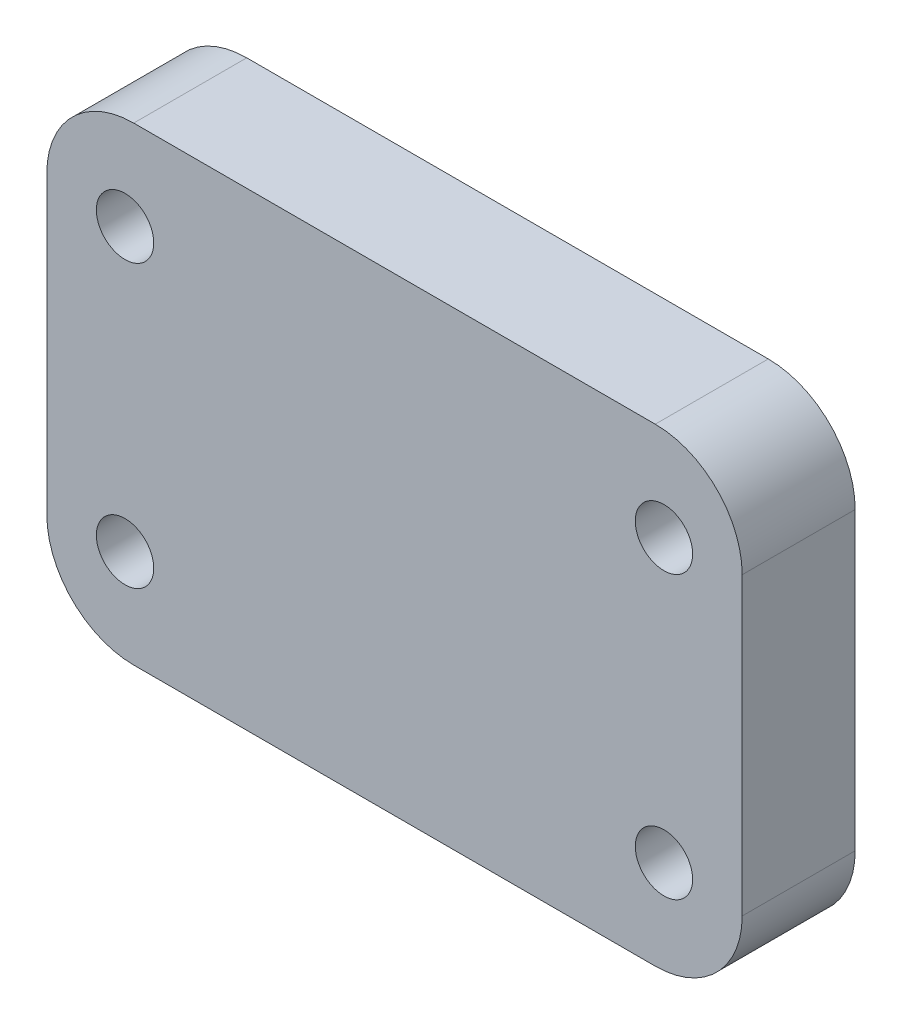
ISO-10303-21;
HEADER;
FILE_DESCRIPTION(('STEP AP214'),'2;1');
FILE_NAME('part.step','',(''),(''),'','','');
FILE_SCHEMA(('AUTOMOTIVE_DESIGN { 1 0 10303 214 1 1 1 1 }'));
ENDSEC;
DATA;
#1=APPLICATION_CONTEXT('core data for automotive mechanical design processes');
#2=APPLICATION_PROTOCOL_DEFINITION('international standard','automotive_design',2000,#1);
#3=PRODUCT_CONTEXT('',#1,'mechanical');
#4=PRODUCT('Part','Part','',(#3));
#5=PRODUCT_RELATED_PRODUCT_CATEGORY('part','',(#4));
#6=PRODUCT_DEFINITION_FORMATION('','',#4);
#7=PRODUCT_DEFINITION_CONTEXT('part definition',#1,'design');
#8=PRODUCT_DEFINITION('design','',#6,#7);
#9=PRODUCT_DEFINITION_SHAPE('','',#8);
#10=(LENGTH_UNIT() NAMED_UNIT(*) SI_UNIT(.MILLI.,.METRE.));
#11=(NAMED_UNIT(*) PLANE_ANGLE_UNIT() SI_UNIT($,.RADIAN.));
#12=(NAMED_UNIT(*) SI_UNIT($,.STERADIAN.) SOLID_ANGLE_UNIT());
#13=UNCERTAINTY_MEASURE_WITH_UNIT(LENGTH_MEASURE(1.E-05),#10,'distance_accuracy_value','');
#14=(GEOMETRIC_REPRESENTATION_CONTEXT(3) GLOBAL_UNCERTAINTY_ASSIGNED_CONTEXT((#13)) GLOBAL_UNIT_ASSIGNED_CONTEXT((#10,
#11,#12)) REPRESENTATION_CONTEXT('',''));
#15=CARTESIAN_POINT('',(0.,0.,0.));
#16=DIRECTION('',(0.,0.,1.));
#17=DIRECTION('',(1.,0.,0.));
#18=AXIS2_PLACEMENT_3D('',#15,#16,#17);
#19=CARTESIAN_POINT('',(0.,29.,26.));
#20=DIRECTION('',(0.,0.,1.));
#21=DIRECTION('',(1.,0.,0.));
#22=AXIS2_PLACEMENT_3D('',#19,#20,#21);
#23=PLANE('',#22);
#24=CARTESIAN_POINT('',(-31.,12.8,26.));
#25=DIRECTION('',(0.,0.,-1.));
#26=DIRECTION('',(-1.,0.,0.));
#27=AXIS2_PLACEMENT_3D('',#24,#25,#26);
#28=CIRCLE('',#27,3.3);
#29=CARTESIAN_POINT('',(-34.3,12.8,26.));
#30=VERTEX_POINT('',#29);
#31=EDGE_CURVE('E137',#30,#30,#28,.T.);
#32=ORIENTED_EDGE('',*,*,#31,.T.);
#33=EDGE_LOOP('',(#32));
#34=FACE_BOUND('',#33,.T.);
#35=CARTESIAN_POINT('',(31.,12.8,26.));
#36=DIRECTION('',(0.,0.,-1.));
#37=DIRECTION('',(-1.,0.,0.));
#38=AXIS2_PLACEMENT_3D('',#35,#36,#37);
#39=CIRCLE('',#38,3.3);
#40=CARTESIAN_POINT('',(27.7,12.8,26.));
#41=VERTEX_POINT('',#40);
#42=EDGE_CURVE('E140',#41,#41,#39,.T.);
#43=ORIENTED_EDGE('',*,*,#42,.T.);
#44=EDGE_LOOP('',(#43));
#45=FACE_BOUND('',#44,.T.);
#46=CARTESIAN_POINT('',(31.,45.2,26.));
#47=DIRECTION('',(0.,0.,-1.));
#48=DIRECTION('',(-1.,0.,0.));
#49=AXIS2_PLACEMENT_3D('',#46,#47,#48);
#50=CIRCLE('',#49,3.3);
#51=CARTESIAN_POINT('',(27.7,45.2,26.));
#52=VERTEX_POINT('',#51);
#53=EDGE_CURVE('E143',#52,#52,#50,.T.);
#54=ORIENTED_EDGE('',*,*,#53,.T.);
#55=EDGE_LOOP('',(#54));
#56=FACE_BOUND('',#55,.T.);
#57=CARTESIAN_POINT('',(-31.,45.2,26.));
#58=DIRECTION('',(0.,0.,-1.));
#59=DIRECTION('',(-1.,0.,0.));
#60=AXIS2_PLACEMENT_3D('',#57,#58,#59);
#61=CIRCLE('',#60,3.3);
#62=CARTESIAN_POINT('',(-34.3,45.2,26.));
#63=VERTEX_POINT('',#62);
#64=EDGE_CURVE('E146',#63,#63,#61,.T.);
#65=ORIENTED_EDGE('',*,*,#64,.T.);
#66=EDGE_LOOP('',(#65));
#67=FACE_BOUND('',#66,.T.);
#68=CARTESIAN_POINT('',(30.,46.,26.));
#69=DIRECTION('',(0.,0.,1.));
#70=DIRECTION('',(1.,0.,0.));
#71=AXIS2_PLACEMENT_3D('',#68,#69,#70);
#72=CIRCLE('',#71,10.);
#73=CARTESIAN_POINT('',(30.,56.,26.));
#74=VERTEX_POINT('',#73);
#75=CARTESIAN_POINT('',(40.,46.,26.));
#76=VERTEX_POINT('',#75);
#77=EDGE_CURVE('E151',#74,#76,#72,.F.);
#78=ORIENTED_EDGE('',*,*,#77,.F.);
#79=DIRECTION('',(-1.,0.,0.));
#80=VECTOR('',#79,1.);
#81=CARTESIAN_POINT('',(30.,56.,26.));
#82=LINE('',#81,#80);
#83=CARTESIAN_POINT('',(-30.,56.,26.));
#84=VERTEX_POINT('',#83);
#85=EDGE_CURVE('E108',#84,#74,#82,.F.);
#86=ORIENTED_EDGE('',*,*,#85,.F.);
#87=CARTESIAN_POINT('',(-30.,46.,26.));
#88=DIRECTION('',(0.,0.,1.));
#89=DIRECTION('',(1.,0.,0.));
#90=AXIS2_PLACEMENT_3D('',#87,#88,#89);
#91=CIRCLE('',#90,10.);
#92=CARTESIAN_POINT('',(-40.,46.,26.));
#93=VERTEX_POINT('',#92);
#94=EDGE_CURVE('E95',#93,#84,#91,.F.);
#95=ORIENTED_EDGE('',*,*,#94,.F.);
#96=DIRECTION('',(0.,-1.,0.));
#97=VECTOR('',#96,1.);
#98=CARTESIAN_POINT('',(-40.,46.,26.));
#99=LINE('',#98,#97);
#100=CARTESIAN_POINT('',(-40.,12.,26.));
#101=VERTEX_POINT('',#100);
#102=EDGE_CURVE('E91',#101,#93,#99,.F.);
#103=ORIENTED_EDGE('',*,*,#102,.F.);
#104=CARTESIAN_POINT('',(-30.,12.,26.));
#105=DIRECTION('',(0.,0.,1.));
#106=DIRECTION('',(1.,0.,0.));
#107=AXIS2_PLACEMENT_3D('',#104,#105,#106);
#108=CIRCLE('',#107,10.);
#109=CARTESIAN_POINT('',(-30.,2.00000000000001,26.));
#110=VERTEX_POINT('',#109);
#111=EDGE_CURVE('E19',#110,#101,#108,.F.);
#112=ORIENTED_EDGE('',*,*,#111,.F.);
#113=DIRECTION('',(1.,0.,0.));
#114=VECTOR('',#113,1.);
#115=CARTESIAN_POINT('',(-30.,2.00000000000001,26.));
#116=LINE('',#115,#114);
#117=CARTESIAN_POINT('',(30.,2.00000000000001,26.));
#118=VERTEX_POINT('',#117);
#119=EDGE_CURVE('E78',#118,#110,#116,.F.);
#120=ORIENTED_EDGE('',*,*,#119,.F.);
#121=CARTESIAN_POINT('',(30.,12.,26.));
#122=DIRECTION('',(0.,0.,1.));
#123=DIRECTION('',(1.,0.,0.));
#124=AXIS2_PLACEMENT_3D('',#121,#122,#123);
#125=CIRCLE('',#124,10.);
#126=CARTESIAN_POINT('',(40.,12.,26.));
#127=VERTEX_POINT('',#126);
#128=EDGE_CURVE('E152',#127,#118,#125,.F.);
#129=ORIENTED_EDGE('',*,*,#128,.F.);
#130=DIRECTION('',(0.,1.,0.));
#131=VECTOR('',#130,1.);
#132=CARTESIAN_POINT('',(40.,12.,26.));
#133=LINE('',#132,#131);
#134=EDGE_CURVE('E112',#76,#127,#133,.F.);
#135=ORIENTED_EDGE('',*,*,#134,.F.);
#136=EDGE_LOOP('',(#78,#86,#95,#103,#112,#120,#129,#135));
#137=FACE_BOUND('',#136,.T.);
#138=ADVANCED_FACE('F16',(#34,#45,#56,#67,#137),#23,.T.);
#139=CARTESIAN_POINT('',(-40.,46.,13.));
#140=DIRECTION('',(-1.,0.,0.));
#141=DIRECTION('',(0.,-1.,0.));
#142=AXIS2_PLACEMENT_3D('',#139,#140,#141);
#143=PLANE('',#142);
#144=ORIENTED_EDGE('',*,*,#102,.T.);
#145=DIRECTION('',(0.,0.,1.));
#146=VECTOR('',#145,1.);
#147=CARTESIAN_POINT('',(-40.,46.,13.));
#148=LINE('',#147,#146);
#149=CARTESIAN_POINT('',(-40.,46.,13.));
#150=VERTEX_POINT('',#149);
#151=EDGE_CURVE('E150',#150,#93,#148,.T.);
#152=ORIENTED_EDGE('',*,*,#151,.F.);
#153=DIRECTION('',(0.,1.,0.));
#154=VECTOR('',#153,1.);
#155=CARTESIAN_POINT('',(-40.,29.,13.));
#156=LINE('',#155,#154);
#157=CARTESIAN_POINT('',(-40.,12.,13.));
#158=VERTEX_POINT('',#157);
#159=EDGE_CURVE('E102',#150,#158,#156,.F.);
#160=ORIENTED_EDGE('',*,*,#159,.T.);
#161=DIRECTION('',(0.,0.,1.));
#162=VECTOR('',#161,1.);
#163=CARTESIAN_POINT('',(-40.,12.,13.));
#164=LINE('',#163,#162);
#165=EDGE_CURVE('E87',#101,#158,#164,.F.);
#166=ORIENTED_EDGE('',*,*,#165,.F.);
#167=EDGE_LOOP('',(#144,#152,#160,#166));
#168=FACE_BOUND('',#167,.T.);
#169=ADVANCED_FACE('F101',(#168),#143,.T.);
#170=CARTESIAN_POINT('',(-30.,12.,13.));
#171=DIRECTION('',(0.,0.,1.));
#172=DIRECTION('',(1.,0.,0.));
#173=AXIS2_PLACEMENT_3D('',#170,#171,#172);
#174=CYLINDRICAL_SURFACE('',#173,10.);
#175=ORIENTED_EDGE('',*,*,#111,.T.);
#176=ORIENTED_EDGE('',*,*,#165,.T.);
#177=CARTESIAN_POINT('',(-30.,12.,13.));
#178=DIRECTION('',(0.,0.,1.));
#179=DIRECTION('',(1.,0.,0.));
#180=AXIS2_PLACEMENT_3D('',#177,#178,#179);
#181=CIRCLE('',#180,10.);
#182=CARTESIAN_POINT('',(-30.,2.00000000000001,13.));
#183=VERTEX_POINT('',#182);
#184=EDGE_CURVE('E135',#158,#183,#181,.T.);
#185=ORIENTED_EDGE('',*,*,#184,.T.);
#186=DIRECTION('',(0.,0.,1.));
#187=VECTOR('',#186,1.);
#188=CARTESIAN_POINT('',(-30.,2.00000000000001,13.));
#189=LINE('',#188,#187);
#190=EDGE_CURVE('E89',#110,#183,#189,.F.);
#191=ORIENTED_EDGE('',*,*,#190,.F.);
#192=EDGE_LOOP('',(#175,#176,#185,#191));
#193=FACE_BOUND('',#192,.T.);
#194=ADVANCED_FACE('F84',(#193),#174,.T.);
#195=CARTESIAN_POINT('',(-30.,2.00000000000001,13.));
#196=DIRECTION('',(0.,-1.,0.));
#197=DIRECTION('',(1.,0.,0.));
#198=AXIS2_PLACEMENT_3D('',#195,#196,#197);
#199=PLANE('',#198);
#200=ORIENTED_EDGE('',*,*,#119,.T.);
#201=ORIENTED_EDGE('',*,*,#190,.T.);
#202=DIRECTION('',(1.,0.,0.));
#203=VECTOR('',#202,1.);
#204=CARTESIAN_POINT('',(0.,2.00000000000001,13.));
#205=LINE('',#204,#203);
#206=CARTESIAN_POINT('',(30.,2.00000000000001,13.));
#207=VERTEX_POINT('',#206);
#208=EDGE_CURVE('E134',#183,#207,#205,.T.);
#209=ORIENTED_EDGE('',*,*,#208,.T.);
#210=DIRECTION('',(0.,0.,1.));
#211=VECTOR('',#210,1.);
#212=CARTESIAN_POINT('',(30.,2.,13.));
#213=LINE('',#212,#211);
#214=EDGE_CURVE('E114',#118,#207,#213,.F.);
#215=ORIENTED_EDGE('',*,*,#214,.F.);
#216=EDGE_LOOP('',(#200,#201,#209,#215));
#217=FACE_BOUND('',#216,.T.);
#218=ADVANCED_FACE('F158',(#217),#199,.T.);
#219=CARTESIAN_POINT('',(30.,12.,13.));
#220=DIRECTION('',(0.,0.,1.));
#221=DIRECTION('',(1.,0.,0.));
#222=AXIS2_PLACEMENT_3D('',#219,#220,#221);
#223=CYLINDRICAL_SURFACE('',#222,10.);
#224=ORIENTED_EDGE('',*,*,#128,.T.);
#225=ORIENTED_EDGE('',*,*,#214,.T.);
#226=CARTESIAN_POINT('',(30.,12.,13.));
#227=DIRECTION('',(0.,0.,1.));
#228=DIRECTION('',(1.,0.,0.));
#229=AXIS2_PLACEMENT_3D('',#226,#227,#228);
#230=CIRCLE('',#229,10.);
#231=CARTESIAN_POINT('',(40.,12.,13.));
#232=VERTEX_POINT('',#231);
#233=EDGE_CURVE('E131',#207,#232,#230,.T.);
#234=ORIENTED_EDGE('',*,*,#233,.T.);
#235=DIRECTION('',(0.,0.,-1.));
#236=VECTOR('',#235,1.);
#237=CARTESIAN_POINT('',(40.,12.,13.));
#238=LINE('',#237,#236);
#239=EDGE_CURVE('E113',#127,#232,#238,.T.);
#240=ORIENTED_EDGE('',*,*,#239,.F.);
#241=EDGE_LOOP('',(#224,#225,#234,#240));
#242=FACE_BOUND('',#241,.T.);
#243=ADVANCED_FACE('F179',(#242),#223,.T.);
#244=CARTESIAN_POINT('',(40.,12.,13.));
#245=DIRECTION('',(1.,0.,0.));
#246=DIRECTION('',(0.,0.,-1.));
#247=AXIS2_PLACEMENT_3D('',#244,#245,#246);
#248=PLANE('',#247);
#249=ORIENTED_EDGE('',*,*,#134,.T.);
#250=ORIENTED_EDGE('',*,*,#239,.T.);
#251=DIRECTION('',(0.,1.,0.));
#252=VECTOR('',#251,1.);
#253=CARTESIAN_POINT('',(40.,29.,13.));
#254=LINE('',#253,#252);
#255=CARTESIAN_POINT('',(40.,46.,13.));
#256=VERTEX_POINT('',#255);
#257=EDGE_CURVE('E130',#232,#256,#254,.T.);
#258=ORIENTED_EDGE('',*,*,#257,.T.);
#259=DIRECTION('',(0.,0.,1.));
#260=VECTOR('',#259,1.);
#261=CARTESIAN_POINT('',(40.,46.,13.));
#262=LINE('',#261,#260);
#263=EDGE_CURVE('E110',#76,#256,#262,.F.);
#264=ORIENTED_EDGE('',*,*,#263,.F.);
#265=EDGE_LOOP('',(#249,#250,#258,#264));
#266=FACE_BOUND('',#265,.T.);
#267=ADVANCED_FACE('F175',(#266),#248,.T.);
#268=CARTESIAN_POINT('',(30.,46.,13.));
#269=DIRECTION('',(0.,0.,1.));
#270=DIRECTION('',(1.,0.,0.));
#271=AXIS2_PLACEMENT_3D('',#268,#269,#270);
#272=CYLINDRICAL_SURFACE('',#271,10.);
#273=ORIENTED_EDGE('',*,*,#77,.T.);
#274=ORIENTED_EDGE('',*,*,#263,.T.);
#275=CARTESIAN_POINT('',(30.,46.,13.));
#276=DIRECTION('',(0.,0.,1.));
#277=DIRECTION('',(1.,0.,0.));
#278=AXIS2_PLACEMENT_3D('',#275,#276,#277);
#279=CIRCLE('',#278,10.);
#280=CARTESIAN_POINT('',(30.,56.,13.));
#281=VERTEX_POINT('',#280);
#282=EDGE_CURVE('E127',#256,#281,#279,.T.);
#283=ORIENTED_EDGE('',*,*,#282,.T.);
#284=DIRECTION('',(0.,0.,1.));
#285=VECTOR('',#284,1.);
#286=CARTESIAN_POINT('',(30.,56.,13.));
#287=LINE('',#286,#285);
#288=EDGE_CURVE('E109',#74,#281,#287,.F.);
#289=ORIENTED_EDGE('',*,*,#288,.F.);
#290=EDGE_LOOP('',(#273,#274,#283,#289));
#291=FACE_BOUND('',#290,.T.);
#292=ADVANCED_FACE('F187',(#291),#272,.T.);
#293=CARTESIAN_POINT('',(30.,56.,13.));
#294=DIRECTION('',(0.,1.,0.));
#295=DIRECTION('',(-1.,0.,0.));
#296=AXIS2_PLACEMENT_3D('',#293,#294,#295);
#297=PLANE('',#296);
#298=ORIENTED_EDGE('',*,*,#85,.T.);
#299=ORIENTED_EDGE('',*,*,#288,.T.);
#300=DIRECTION('',(1.,0.,0.));
#301=VECTOR('',#300,1.);
#302=CARTESIAN_POINT('',(0.,56.,13.));
#303=LINE('',#302,#301);
#304=CARTESIAN_POINT('',(-30.,56.,13.));
#305=VERTEX_POINT('',#304);
#306=EDGE_CURVE('E126',#281,#305,#303,.F.);
#307=ORIENTED_EDGE('',*,*,#306,.T.);
#308=DIRECTION('',(0.,0.,1.));
#309=VECTOR('',#308,1.);
#310=CARTESIAN_POINT('',(-30.,56.,13.));
#311=LINE('',#310,#309);
#312=EDGE_CURVE('E34',#84,#305,#311,.F.);
#313=ORIENTED_EDGE('',*,*,#312,.F.);
#314=EDGE_LOOP('',(#298,#299,#307,#313));
#315=FACE_BOUND('',#314,.T.);
#316=ADVANCED_FACE('F217',(#315),#297,.T.);
#317=CARTESIAN_POINT('',(-30.,46.,13.));
#318=DIRECTION('',(0.,0.,1.));
#319=DIRECTION('',(1.,0.,0.));
#320=AXIS2_PLACEMENT_3D('',#317,#318,#319);
#321=CYLINDRICAL_SURFACE('',#320,10.);
#322=ORIENTED_EDGE('',*,*,#94,.T.);
#323=ORIENTED_EDGE('',*,*,#312,.T.);
#324=CARTESIAN_POINT('',(-30.,46.,13.));
#325=DIRECTION('',(0.,0.,1.));
#326=DIRECTION('',(1.,0.,0.));
#327=AXIS2_PLACEMENT_3D('',#324,#325,#326);
#328=CIRCLE('',#327,10.);
#329=EDGE_CURVE('E124',#305,#150,#328,.T.);
#330=ORIENTED_EDGE('',*,*,#329,.T.);
#331=ORIENTED_EDGE('',*,*,#151,.T.);
#332=EDGE_LOOP('',(#322,#323,#330,#331));
#333=FACE_BOUND('',#332,.T.);
#334=ADVANCED_FACE('F213',(#333),#321,.T.);
#335=CARTESIAN_POINT('',(-31.,45.2,23.4));
#336=DIRECTION('',(0.,0.,-1.));
#337=DIRECTION('',(-1.,0.,0.));
#338=AXIS2_PLACEMENT_3D('',#335,#336,#337);
#339=CYLINDRICAL_SURFACE('',#338,3.3);
#340=CARTESIAN_POINT('',(-31.,45.2,13.));
#341=DIRECTION('',(0.,0.,-1.));
#342=DIRECTION('',(-1.,0.,0.));
#343=AXIS2_PLACEMENT_3D('',#340,#341,#342);
#344=CIRCLE('',#343,3.3);
#345=CARTESIAN_POINT('',(-34.3,45.2,13.));
#346=VERTEX_POINT('',#345);
#347=EDGE_CURVE('E121',#346,#346,#344,.T.);
#348=ORIENTED_EDGE('',*,*,#347,.T.);
#349=EDGE_LOOP('',(#348));
#350=FACE_BOUND('',#349,.T.);
#351=ORIENTED_EDGE('',*,*,#64,.F.);
#352=EDGE_LOOP('',(#351));
#353=FACE_BOUND('',#352,.T.);
#354=ADVANCED_FACE('F209',(#350,#353),#339,.F.);
#355=CARTESIAN_POINT('',(31.,45.2,23.4));
#356=DIRECTION('',(0.,0.,-1.));
#357=DIRECTION('',(-1.,0.,0.));
#358=AXIS2_PLACEMENT_3D('',#355,#356,#357);
#359=CYLINDRICAL_SURFACE('',#358,3.3);
#360=CARTESIAN_POINT('',(31.,45.2,13.));
#361=DIRECTION('',(0.,0.,-1.));
#362=DIRECTION('',(-1.,0.,0.));
#363=AXIS2_PLACEMENT_3D('',#360,#361,#362);
#364=CIRCLE('',#363,3.3);
#365=CARTESIAN_POINT('',(27.7,45.2,13.));
#366=VERTEX_POINT('',#365);
#367=EDGE_CURVE('E118',#366,#366,#364,.T.);
#368=ORIENTED_EDGE('',*,*,#367,.T.);
#369=EDGE_LOOP('',(#368));
#370=FACE_BOUND('',#369,.T.);
#371=ORIENTED_EDGE('',*,*,#53,.F.);
#372=EDGE_LOOP('',(#371));
#373=FACE_BOUND('',#372,.T.);
#374=ADVANCED_FACE('F205',(#370,#373),#359,.F.);
#375=CARTESIAN_POINT('',(31.,12.8,23.4));
#376=DIRECTION('',(0.,0.,-1.));
#377=DIRECTION('',(-1.,0.,0.));
#378=AXIS2_PLACEMENT_3D('',#375,#376,#377);
#379=CYLINDRICAL_SURFACE('',#378,3.3);
#380=CARTESIAN_POINT('',(31.,12.8,13.));
#381=DIRECTION('',(0.,0.,-1.));
#382=DIRECTION('',(-1.,0.,0.));
#383=AXIS2_PLACEMENT_3D('',#380,#381,#382);
#384=CIRCLE('',#383,3.3);
#385=CARTESIAN_POINT('',(27.7,12.8,13.));
#386=VERTEX_POINT('',#385);
#387=EDGE_CURVE('E25',#386,#386,#384,.T.);
#388=ORIENTED_EDGE('',*,*,#387,.T.);
#389=EDGE_LOOP('',(#388));
#390=FACE_BOUND('',#389,.T.);
#391=ORIENTED_EDGE('',*,*,#42,.F.);
#392=EDGE_LOOP('',(#391));
#393=FACE_BOUND('',#392,.T.);
#394=ADVANCED_FACE('F197',(#390,#393),#379,.F.);
#395=CARTESIAN_POINT('',(-31.,12.8,23.4));
#396=DIRECTION('',(0.,0.,-1.));
#397=DIRECTION('',(-1.,0.,0.));
#398=AXIS2_PLACEMENT_3D('',#395,#396,#397);
#399=CYLINDRICAL_SURFACE('',#398,3.3);
#400=CARTESIAN_POINT('',(-31.,12.8,13.));
#401=DIRECTION('',(0.,0.,-1.));
#402=DIRECTION('',(-1.,0.,0.));
#403=AXIS2_PLACEMENT_3D('',#400,#401,#402);
#404=CIRCLE('',#403,3.3);
#405=CARTESIAN_POINT('',(-34.3,12.8,13.));
#406=VERTEX_POINT('',#405);
#407=EDGE_CURVE('E11',#406,#406,#404,.T.);
#408=ORIENTED_EDGE('',*,*,#407,.T.);
#409=EDGE_LOOP('',(#408));
#410=FACE_BOUND('',#409,.T.);
#411=ORIENTED_EDGE('',*,*,#31,.F.);
#412=EDGE_LOOP('',(#411));
#413=FACE_BOUND('',#412,.T.);
#414=ADVANCED_FACE('F191',(#410,#413),#399,.F.);
#415=CARTESIAN_POINT('',(0.,29.,13.));
#416=DIRECTION('',(0.,0.,1.));
#417=DIRECTION('',(1.,0.,0.));
#418=AXIS2_PLACEMENT_3D('',#415,#416,#417);
#419=PLANE('',#418);
#420=ORIENTED_EDGE('',*,*,#407,.F.);
#421=EDGE_LOOP('',(#420));
#422=FACE_BOUND('',#421,.T.);
#423=ORIENTED_EDGE('',*,*,#387,.F.);
#424=EDGE_LOOP('',(#423));
#425=FACE_BOUND('',#424,.T.);
#426=ORIENTED_EDGE('',*,*,#367,.F.);
#427=EDGE_LOOP('',(#426));
#428=FACE_BOUND('',#427,.T.);
#429=ORIENTED_EDGE('',*,*,#347,.F.);
#430=EDGE_LOOP('',(#429));
#431=FACE_BOUND('',#430,.T.);
#432=ORIENTED_EDGE('',*,*,#306,.F.);
#433=ORIENTED_EDGE('',*,*,#282,.F.);
#434=ORIENTED_EDGE('',*,*,#257,.F.);
#435=ORIENTED_EDGE('',*,*,#233,.F.);
#436=ORIENTED_EDGE('',*,*,#208,.F.);
#437=ORIENTED_EDGE('',*,*,#184,.F.);
#438=ORIENTED_EDGE('',*,*,#159,.F.);
#439=ORIENTED_EDGE('',*,*,#329,.F.);
#440=EDGE_LOOP('',(#432,#433,#434,#435,#436,#437,#438,#439));
#441=FACE_BOUND('',#440,.T.);
#442=ADVANCED_FACE('F162',(#422,#425,#428,#431,#441),#419,.F.);
#443=CLOSED_SHELL('',(#138,#169,#194,#218,#243,#267,#292,#316,#334,#354,#374,#394,#414,#442));
#444=MANIFOLD_SOLID_BREP('B1',#443);
#445=ADVANCED_BREP_SHAPE_REPRESENTATION('',(#18,#444),#14);
#446=SHAPE_DEFINITION_REPRESENTATION(#9,#445);
ENDSEC;
END-ISO-10303-21;
